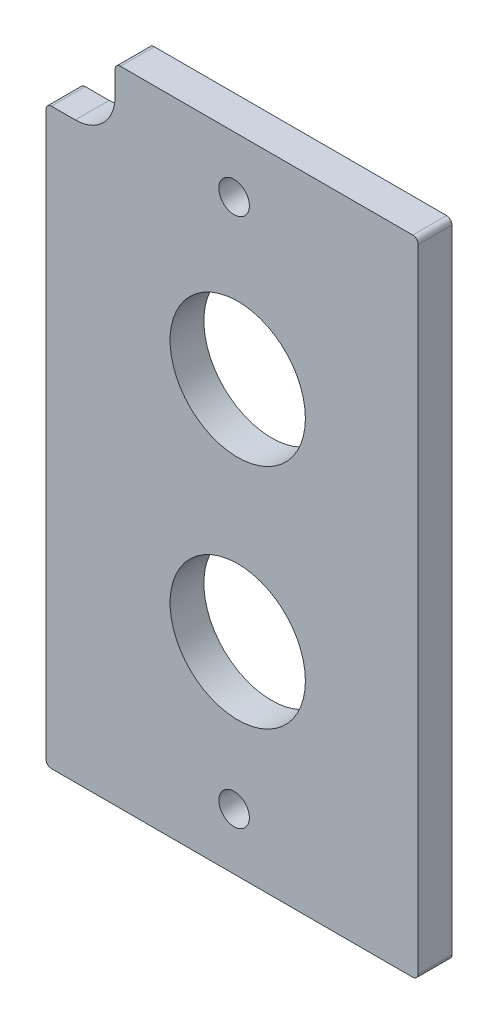
ISO-10303-21;
HEADER;
FILE_DESCRIPTION(('STEP AP214'),'2;1');
FILE_NAME('part.step','',(''),(''),'','','');
FILE_SCHEMA(('AUTOMOTIVE_DESIGN { 1 0 10303 214 1 1 1 1 }'));
ENDSEC;
DATA;
#1=APPLICATION_CONTEXT('core data for automotive mechanical design processes');
#2=APPLICATION_PROTOCOL_DEFINITION('international standard','automotive_design',2000,#1);
#3=PRODUCT_CONTEXT('',#1,'mechanical');
#4=PRODUCT('Part','Part','',(#3));
#5=PRODUCT_RELATED_PRODUCT_CATEGORY('part','',(#4));
#6=PRODUCT_DEFINITION_FORMATION('','',#4);
#7=PRODUCT_DEFINITION_CONTEXT('part definition',#1,'design');
#8=PRODUCT_DEFINITION('design','',#6,#7);
#9=PRODUCT_DEFINITION_SHAPE('','',#8);
#10=(LENGTH_UNIT() NAMED_UNIT(*) SI_UNIT(.MILLI.,.METRE.));
#11=(NAMED_UNIT(*) PLANE_ANGLE_UNIT() SI_UNIT($,.RADIAN.));
#12=(NAMED_UNIT(*) SI_UNIT($,.STERADIAN.) SOLID_ANGLE_UNIT());
#13=UNCERTAINTY_MEASURE_WITH_UNIT(LENGTH_MEASURE(1.E-05),#10,'distance_accuracy_value','');
#14=(GEOMETRIC_REPRESENTATION_CONTEXT(3) GLOBAL_UNCERTAINTY_ASSIGNED_CONTEXT((#13)) GLOBAL_UNIT_ASSIGNED_CONTEXT((#10,
#11,#12)) REPRESENTATION_CONTEXT('',''));
#15=CARTESIAN_POINT('',(0.,0.,0.));
#16=DIRECTION('',(0.,0.,1.));
#17=DIRECTION('',(1.,0.,0.));
#18=AXIS2_PLACEMENT_3D('',#15,#16,#17);
#19=CARTESIAN_POINT('',(-50.8,130.175,4.7625));
#20=DIRECTION('',(0.,0.,-1.));
#21=DIRECTION('',(-1.,0.,0.));
#22=AXIS2_PLACEMENT_3D('',#19,#20,#21);
#23=CYLINDRICAL_SURFACE('',#22,5.58799999999998);
#24=CARTESIAN_POINT('',(-50.8,130.175,0.));
#25=DIRECTION('',(0.,0.,-1.));
#26=DIRECTION('',(1.,0.,0.));
#27=AXIS2_PLACEMENT_3D('',#24,#25,#26);
#28=CIRCLE('',#27,5.58799999999998);
#29=CARTESIAN_POINT('',(-45.212,130.175,0.));
#30=VERTEX_POINT('',#29);
#31=CARTESIAN_POINT('',(-50.8,124.587,0.));
#32=VERTEX_POINT('',#31);
#33=EDGE_CURVE('E152',#30,#32,#28,.T.);
#34=ORIENTED_EDGE('',*,*,#33,.T.);
#35=DIRECTION('',(0.,0.,-1.));
#36=VECTOR('',#35,1.);
#37=CARTESIAN_POINT('',(-50.8,124.587,4.7625));
#38=LINE('',#37,#36);
#39=CARTESIAN_POINT('',(-50.8,124.587,4.7625));
#40=VERTEX_POINT('',#39);
#41=EDGE_CURVE('E11',#40,#32,#38,.T.);
#42=ORIENTED_EDGE('',*,*,#41,.F.);
#43=CARTESIAN_POINT('',(-50.8,130.175,4.7625));
#44=DIRECTION('',(0.,0.,-1.));
#45=DIRECTION('',(1.,0.,0.));
#46=AXIS2_PLACEMENT_3D('',#43,#44,#45);
#47=CIRCLE('',#46,5.58799999999998);
#48=CARTESIAN_POINT('',(-45.212,130.175,4.7625));
#49=VERTEX_POINT('',#48);
#50=EDGE_CURVE('E175',#49,#40,#47,.T.);
#51=ORIENTED_EDGE('',*,*,#50,.F.);
#52=DIRECTION('',(0.,0.,-1.));
#53=VECTOR('',#52,1.);
#54=CARTESIAN_POINT('',(-45.212,130.175,4.7625));
#55=LINE('',#54,#53);
#56=EDGE_CURVE('E148',#49,#30,#55,.T.);
#57=ORIENTED_EDGE('',*,*,#56,.T.);
#58=EDGE_LOOP('',(#34,#42,#51,#57));
#59=FACE_BOUND('',#58,.T.);
#60=ADVANCED_FACE('F32',(#59),#23,.F.);
#61=CARTESIAN_POINT('',(-50.8,124.587,4.7625));
#62=DIRECTION('',(0.,-1.,0.));
#63=DIRECTION('',(1.,0.,0.));
#64=AXIS2_PLACEMENT_3D('',#61,#62,#63);
#65=PLANE('',#64);
#66=DIRECTION('',(-1.,0.,0.));
#67=VECTOR('',#66,1.);
#68=CARTESIAN_POINT('',(-50.8,124.587,0.));
#69=LINE('',#68,#67);
#70=CARTESIAN_POINT('',(-54.1655,124.587,0.));
#71=VERTEX_POINT('',#70);
#72=EDGE_CURVE('E155',#32,#71,#69,.T.);
#73=ORIENTED_EDGE('',*,*,#72,.T.);
#74=DIRECTION('',(0.,0.,-1.));
#75=VECTOR('',#74,1.);
#76=CARTESIAN_POINT('',(-54.1655,124.587,4.7625));
#77=LINE('',#76,#75);
#78=CARTESIAN_POINT('',(-54.1655,124.587,4.7625));
#79=VERTEX_POINT('',#78);
#80=EDGE_CURVE('E40',#79,#71,#77,.T.);
#81=ORIENTED_EDGE('',*,*,#80,.F.);
#82=DIRECTION('',(-1.,0.,0.));
#83=VECTOR('',#82,1.);
#84=CARTESIAN_POINT('',(-50.8,124.587,4.7625));
#85=LINE('',#84,#83);
#86=EDGE_CURVE('E103',#40,#79,#85,.T.);
#87=ORIENTED_EDGE('',*,*,#86,.F.);
#88=ORIENTED_EDGE('',*,*,#41,.T.);
#89=EDGE_LOOP('',(#73,#81,#87,#88));
#90=FACE_BOUND('',#89,.T.);
#91=ADVANCED_FACE('F254',(#90),#65,.F.);
#92=CARTESIAN_POINT('',(-54.1655,123.825,4.7625));
#93=DIRECTION('',(0.,0.,-1.));
#94=DIRECTION('',(-1.,0.,0.));
#95=AXIS2_PLACEMENT_3D('',#92,#93,#94);
#96=CYLINDRICAL_SURFACE('',#95,0.762000000000002);
#97=CARTESIAN_POINT('',(-54.1655,123.825,0.));
#98=DIRECTION('',(0.,0.,1.));
#99=DIRECTION('',(1.,0.,0.));
#100=AXIS2_PLACEMENT_3D('',#97,#98,#99);
#101=CIRCLE('',#100,0.762000000000002);
#102=CARTESIAN_POINT('',(-54.9275,123.825,0.));
#103=VERTEX_POINT('',#102);
#104=EDGE_CURVE('E158',#71,#103,#101,.T.);
#105=ORIENTED_EDGE('',*,*,#104,.T.);
#106=DIRECTION('',(0.,0.,-1.));
#107=VECTOR('',#106,1.);
#108=CARTESIAN_POINT('',(-54.9275,123.825,4.7625));
#109=LINE('',#108,#107);
#110=CARTESIAN_POINT('',(-54.9275,123.825,4.7625));
#111=VERTEX_POINT('',#110);
#112=EDGE_CURVE('E194',#111,#103,#109,.T.);
#113=ORIENTED_EDGE('',*,*,#112,.F.);
#114=CARTESIAN_POINT('',(-54.1655,123.825,4.7625));
#115=DIRECTION('',(0.,0.,1.));
#116=DIRECTION('',(1.,0.,0.));
#117=AXIS2_PLACEMENT_3D('',#114,#115,#116);
#118=CIRCLE('',#117,0.762000000000002);
#119=EDGE_CURVE('E202',#79,#111,#118,.T.);
#120=ORIENTED_EDGE('',*,*,#119,.F.);
#121=ORIENTED_EDGE('',*,*,#80,.T.);
#122=EDGE_LOOP('',(#105,#113,#120,#121));
#123=FACE_BOUND('',#122,.T.);
#124=ADVANCED_FACE('F200',(#123),#96,.T.);
#125=CARTESIAN_POINT('',(-54.9275,123.825,4.7625));
#126=DIRECTION('',(1.,0.,0.));
#127=DIRECTION('',(0.,1.,0.));
#128=AXIS2_PLACEMENT_3D('',#125,#126,#127);
#129=PLANE('',#128);
#130=DIRECTION('',(0.,-1.,0.));
#131=VECTOR('',#130,1.);
#132=CARTESIAN_POINT('',(-54.9275,123.825,0.));
#133=LINE('',#132,#131);
#134=CARTESIAN_POINT('',(-54.9274999999998,44.577,0.));
#135=VERTEX_POINT('',#134);
#136=EDGE_CURVE('E160',#103,#135,#133,.T.);
#137=ORIENTED_EDGE('',*,*,#136,.T.);
#138=DIRECTION('',(0.,0.,-1.));
#139=VECTOR('',#138,1.);
#140=CARTESIAN_POINT('',(-54.9274999999998,44.577,4.7625));
#141=LINE('',#140,#139);
#142=CARTESIAN_POINT('',(-54.9274999999998,44.577,4.7625));
#143=VERTEX_POINT('',#142);
#144=EDGE_CURVE('E191',#143,#135,#141,.T.);
#145=ORIENTED_EDGE('',*,*,#144,.F.);
#146=DIRECTION('',(0.,-1.,0.));
#147=VECTOR('',#146,1.);
#148=CARTESIAN_POINT('',(-54.9275,123.825,4.7625));
#149=LINE('',#148,#147);
#150=EDGE_CURVE('E220',#111,#143,#149,.T.);
#151=ORIENTED_EDGE('',*,*,#150,.F.);
#152=ORIENTED_EDGE('',*,*,#112,.T.);
#153=EDGE_LOOP('',(#137,#145,#151,#152));
#154=FACE_BOUND('',#153,.T.);
#155=ADVANCED_FACE('F211',(#154),#129,.F.);
#156=CARTESIAN_POINT('',(-54.1654999999997,44.577,4.7625));
#157=DIRECTION('',(0.,0.,-1.));
#158=DIRECTION('',(-1.,0.,0.));
#159=AXIS2_PLACEMENT_3D('',#156,#157,#158);
#160=CYLINDRICAL_SURFACE('',#159,0.762000000000034);
#161=CARTESIAN_POINT('',(-54.1654999999997,44.577,0.));
#162=DIRECTION('',(0.,0.,1.));
#163=DIRECTION('',(1.,0.,0.));
#164=AXIS2_PLACEMENT_3D('',#161,#162,#163);
#165=CIRCLE('',#164,0.762000000000034);
#166=CARTESIAN_POINT('',(-54.1654999999997,43.815,0.));
#167=VERTEX_POINT('',#166);
#168=EDGE_CURVE('E162',#135,#167,#165,.T.);
#169=ORIENTED_EDGE('',*,*,#168,.T.);
#170=DIRECTION('',(0.,0.,-1.));
#171=VECTOR('',#170,1.);
#172=CARTESIAN_POINT('',(-54.1654999999997,43.815,4.7625));
#173=LINE('',#172,#171);
#174=CARTESIAN_POINT('',(-54.1654999999997,43.815,4.7625));
#175=VERTEX_POINT('',#174);
#176=EDGE_CURVE('E188',#175,#167,#173,.T.);
#177=ORIENTED_EDGE('',*,*,#176,.F.);
#178=CARTESIAN_POINT('',(-54.1654999999997,44.577,4.7625));
#179=DIRECTION('',(0.,0.,1.));
#180=DIRECTION('',(1.,0.,0.));
#181=AXIS2_PLACEMENT_3D('',#178,#179,#180);
#182=CIRCLE('',#181,0.762000000000034);
#183=EDGE_CURVE('E217',#143,#175,#182,.T.);
#184=ORIENTED_EDGE('',*,*,#183,.F.);
#185=ORIENTED_EDGE('',*,*,#144,.T.);
#186=EDGE_LOOP('',(#169,#177,#184,#185));
#187=FACE_BOUND('',#186,.T.);
#188=ADVANCED_FACE('F215',(#187),#160,.T.);
#189=CARTESIAN_POINT('',(-54.1654999999997,43.815,4.7625));
#190=DIRECTION('',(0.,1.,0.));
#191=DIRECTION('',(0.,0.,1.));
#192=AXIS2_PLACEMENT_3D('',#189,#190,#191);
#193=PLANE('',#192);
#194=DIRECTION('',(1.,0.,0.));
#195=VECTOR('',#194,1.);
#196=CARTESIAN_POINT('',(-54.1654999999997,43.815,0.));
#197=LINE('',#196,#195);
#198=CARTESIAN_POINT('',(-3.302,43.815,0.));
#199=VERTEX_POINT('',#198);
#200=EDGE_CURVE('E164',#167,#199,#197,.T.);
#201=ORIENTED_EDGE('',*,*,#200,.T.);
#202=DIRECTION('',(0.,0.,-1.));
#203=VECTOR('',#202,1.);
#204=CARTESIAN_POINT('',(-3.302,43.815,4.7625));
#205=LINE('',#204,#203);
#206=CARTESIAN_POINT('',(-3.302,43.815,4.7625));
#207=VERTEX_POINT('',#206);
#208=EDGE_CURVE('E185',#207,#199,#205,.T.);
#209=ORIENTED_EDGE('',*,*,#208,.F.);
#210=DIRECTION('',(1.,0.,0.));
#211=VECTOR('',#210,1.);
#212=CARTESIAN_POINT('',(-54.1654999999997,43.815,4.7625));
#213=LINE('',#212,#211);
#214=EDGE_CURVE('E219',#175,#207,#213,.T.);
#215=ORIENTED_EDGE('',*,*,#214,.F.);
#216=ORIENTED_EDGE('',*,*,#176,.T.);
#217=EDGE_LOOP('',(#201,#209,#215,#216));
#218=FACE_BOUND('',#217,.T.);
#219=ADVANCED_FACE('F267',(#218),#193,.F.);
#220=CARTESIAN_POINT('',(-3.302,44.577,4.7625));
#221=DIRECTION('',(0.,0.,-1.));
#222=DIRECTION('',(-1.,0.,0.));
#223=AXIS2_PLACEMENT_3D('',#220,#221,#222);
#224=CYLINDRICAL_SURFACE('',#223,0.761999999999999);
#225=CARTESIAN_POINT('',(-3.302,44.577,0.));
#226=DIRECTION('',(0.,0.,1.));
#227=DIRECTION('',(1.,0.,0.));
#228=AXIS2_PLACEMENT_3D('',#225,#226,#227);
#229=CIRCLE('',#228,0.761999999999999);
#230=CARTESIAN_POINT('',(-2.54,44.577,0.));
#231=VERTEX_POINT('',#230);
#232=EDGE_CURVE('E166',#199,#231,#229,.T.);
#233=ORIENTED_EDGE('',*,*,#232,.T.);
#234=DIRECTION('',(0.,0.,-1.));
#235=VECTOR('',#234,1.);
#236=CARTESIAN_POINT('',(-2.54,44.577,4.7625));
#237=LINE('',#236,#235);
#238=CARTESIAN_POINT('',(-2.54,44.577,4.7625));
#239=VERTEX_POINT('',#238);
#240=EDGE_CURVE('E182',#239,#231,#237,.T.);
#241=ORIENTED_EDGE('',*,*,#240,.F.);
#242=CARTESIAN_POINT('',(-3.302,44.577,4.7625));
#243=DIRECTION('',(0.,0.,1.));
#244=DIRECTION('',(1.,0.,0.));
#245=AXIS2_PLACEMENT_3D('',#242,#243,#244);
#246=CIRCLE('',#245,0.761999999999999);
#247=EDGE_CURVE('E222',#207,#239,#246,.T.);
#248=ORIENTED_EDGE('',*,*,#247,.F.);
#249=ORIENTED_EDGE('',*,*,#208,.T.);
#250=EDGE_LOOP('',(#233,#241,#248,#249));
#251=FACE_BOUND('',#250,.T.);
#252=ADVANCED_FACE('F270',(#251),#224,.T.);
#253=CARTESIAN_POINT('',(-2.54,44.577,4.7625));
#254=DIRECTION('',(-1.,0.,0.));
#255=DIRECTION('',(0.,-1.,0.));
#256=AXIS2_PLACEMENT_3D('',#253,#254,#255);
#257=PLANE('',#256);
#258=DIRECTION('',(0.,1.,0.));
#259=VECTOR('',#258,1.);
#260=CARTESIAN_POINT('',(-2.54,44.577,0.));
#261=LINE('',#260,#259);
#262=CARTESIAN_POINT('',(-2.54000000000001,133.5405,0.));
#263=VERTEX_POINT('',#262);
#264=EDGE_CURVE('E168',#231,#263,#261,.T.);
#265=ORIENTED_EDGE('',*,*,#264,.T.);
#266=DIRECTION('',(0.,0.,-1.));
#267=VECTOR('',#266,1.);
#268=CARTESIAN_POINT('',(-2.54000000000001,133.5405,4.7625));
#269=LINE('',#268,#267);
#270=CARTESIAN_POINT('',(-2.54000000000001,133.5405,4.7625));
#271=VERTEX_POINT('',#270);
#272=EDGE_CURVE('E179',#271,#263,#269,.T.);
#273=ORIENTED_EDGE('',*,*,#272,.F.);
#274=DIRECTION('',(0.,1.,0.));
#275=VECTOR('',#274,1.);
#276=CARTESIAN_POINT('',(-2.54,44.577,4.7625));
#277=LINE('',#276,#275);
#278=EDGE_CURVE('E228',#239,#271,#277,.T.);
#279=ORIENTED_EDGE('',*,*,#278,.F.);
#280=ORIENTED_EDGE('',*,*,#240,.T.);
#281=EDGE_LOOP('',(#265,#273,#279,#280));
#282=FACE_BOUND('',#281,.T.);
#283=ADVANCED_FACE('F234',(#282),#257,.F.);
#284=CARTESIAN_POINT('',(-3.302,133.5405,4.7625));
#285=DIRECTION('',(0.,0.,-1.));
#286=DIRECTION('',(-1.,0.,0.));
#287=AXIS2_PLACEMENT_3D('',#284,#285,#286);
#288=CYLINDRICAL_SURFACE('',#287,0.761999999999989);
#289=CARTESIAN_POINT('',(-3.302,133.5405,0.));
#290=DIRECTION('',(0.,0.,1.));
#291=DIRECTION('',(1.,0.,0.));
#292=AXIS2_PLACEMENT_3D('',#289,#290,#291);
#293=CIRCLE('',#292,0.761999999999989);
#294=CARTESIAN_POINT('',(-3.302,134.3025,0.));
#295=VERTEX_POINT('',#294);
#296=EDGE_CURVE('E170',#263,#295,#293,.T.);
#297=ORIENTED_EDGE('',*,*,#296,.T.);
#298=DIRECTION('',(0.,0.,-1.));
#299=VECTOR('',#298,1.);
#300=CARTESIAN_POINT('',(-3.302,134.3025,4.7625));
#301=LINE('',#300,#299);
#302=CARTESIAN_POINT('',(-3.302,134.3025,4.7625));
#303=VERTEX_POINT('',#302);
#304=EDGE_CURVE('E143',#303,#295,#301,.T.);
#305=ORIENTED_EDGE('',*,*,#304,.F.);
#306=CARTESIAN_POINT('',(-3.302,133.5405,4.7625));
#307=DIRECTION('',(0.,0.,1.));
#308=DIRECTION('',(1.,0.,0.));
#309=AXIS2_PLACEMENT_3D('',#306,#307,#308);
#310=CIRCLE('',#309,0.761999999999989);
#311=EDGE_CURVE('E134',#271,#303,#310,.T.);
#312=ORIENTED_EDGE('',*,*,#311,.F.);
#313=ORIENTED_EDGE('',*,*,#272,.T.);
#314=EDGE_LOOP('',(#297,#305,#312,#313));
#315=FACE_BOUND('',#314,.T.);
#316=ADVANCED_FACE('F238',(#315),#288,.T.);
#317=CARTESIAN_POINT('',(-3.302,134.3025,4.7625));
#318=DIRECTION('',(0.,-1.,0.));
#319=DIRECTION('',(0.,0.,-1.));
#320=AXIS2_PLACEMENT_3D('',#317,#318,#319);
#321=PLANE('',#320);
#322=DIRECTION('',(-1.,0.,0.));
#323=VECTOR('',#322,1.);
#324=CARTESIAN_POINT('',(-3.302,134.3025,0.));
#325=LINE('',#324,#323);
#326=CARTESIAN_POINT('',(-44.45,134.3025,0.));
#327=VERTEX_POINT('',#326);
#328=EDGE_CURVE('E142',#295,#327,#325,.T.);
#329=ORIENTED_EDGE('',*,*,#328,.T.);
#330=DIRECTION('',(0.,0.,-1.));
#331=VECTOR('',#330,1.);
#332=CARTESIAN_POINT('',(-44.45,134.3025,4.7625));
#333=LINE('',#332,#331);
#334=CARTESIAN_POINT('',(-44.45,134.3025,4.7625));
#335=VERTEX_POINT('',#334);
#336=EDGE_CURVE('E139',#335,#327,#333,.T.);
#337=ORIENTED_EDGE('',*,*,#336,.F.);
#338=DIRECTION('',(-1.,0.,0.));
#339=VECTOR('',#338,1.);
#340=CARTESIAN_POINT('',(-3.302,134.3025,4.7625));
#341=LINE('',#340,#339);
#342=EDGE_CURVE('E128',#303,#335,#341,.T.);
#343=ORIENTED_EDGE('',*,*,#342,.F.);
#344=ORIENTED_EDGE('',*,*,#304,.T.);
#345=EDGE_LOOP('',(#329,#337,#343,#344));
#346=FACE_BOUND('',#345,.T.);
#347=ADVANCED_FACE('F140',(#346),#321,.F.);
#348=CARTESIAN_POINT('',(-44.45,133.5405,4.7625));
#349=DIRECTION('',(0.,0.,-1.));
#350=DIRECTION('',(-1.,0.,0.));
#351=AXIS2_PLACEMENT_3D('',#348,#349,#350);
#352=CYLINDRICAL_SURFACE('',#351,0.761999999999992);
#353=CARTESIAN_POINT('',(-44.45,133.5405,0.));
#354=DIRECTION('',(0.,0.,1.));
#355=DIRECTION('',(1.,0.,0.));
#356=AXIS2_PLACEMENT_3D('',#353,#354,#355);
#357=CIRCLE('',#356,0.761999999999992);
#358=CARTESIAN_POINT('',(-45.212,133.5405,0.));
#359=VERTEX_POINT('',#358);
#360=EDGE_CURVE('E89',#327,#359,#357,.T.);
#361=ORIENTED_EDGE('',*,*,#360,.T.);
#362=DIRECTION('',(0.,0.,-1.));
#363=VECTOR('',#362,1.);
#364=CARTESIAN_POINT('',(-45.212,133.5405,4.7625));
#365=LINE('',#364,#363);
#366=CARTESIAN_POINT('',(-45.212,133.5405,4.7625));
#367=VERTEX_POINT('',#366);
#368=EDGE_CURVE('E144',#367,#359,#365,.T.);
#369=ORIENTED_EDGE('',*,*,#368,.F.);
#370=CARTESIAN_POINT('',(-44.45,133.5405,4.7625));
#371=DIRECTION('',(0.,0.,1.));
#372=DIRECTION('',(1.,0.,0.));
#373=AXIS2_PLACEMENT_3D('',#370,#371,#372);
#374=CIRCLE('',#373,0.761999999999992);
#375=EDGE_CURVE('E132',#335,#367,#374,.T.);
#376=ORIENTED_EDGE('',*,*,#375,.F.);
#377=ORIENTED_EDGE('',*,*,#336,.T.);
#378=EDGE_LOOP('',(#361,#369,#376,#377));
#379=FACE_BOUND('',#378,.T.);
#380=ADVANCED_FACE('F146',(#379),#352,.T.);
#381=CARTESIAN_POINT('',(-45.212,133.5405,4.7625));
#382=DIRECTION('',(1.,0.,0.));
#383=DIRECTION('',(0.,1.,0.));
#384=AXIS2_PLACEMENT_3D('',#381,#382,#383);
#385=PLANE('',#384);
#386=DIRECTION('',(0.,-1.,0.));
#387=VECTOR('',#386,1.);
#388=CARTESIAN_POINT('',(-45.212,133.5405,0.));
#389=LINE('',#388,#387);
#390=EDGE_CURVE('E95',#359,#30,#389,.T.);
#391=ORIENTED_EDGE('',*,*,#390,.T.);
#392=ORIENTED_EDGE('',*,*,#56,.F.);
#393=DIRECTION('',(0.,-1.,0.));
#394=VECTOR('',#393,1.);
#395=CARTESIAN_POINT('',(-45.212,133.5405,4.7625));
#396=LINE('',#395,#394);
#397=EDGE_CURVE('E48',#367,#49,#396,.T.);
#398=ORIENTED_EDGE('',*,*,#397,.F.);
#399=ORIENTED_EDGE('',*,*,#368,.T.);
#400=EDGE_LOOP('',(#391,#392,#398,#399));
#401=FACE_BOUND('',#400,.T.);
#402=ADVANCED_FACE('F242',(#401),#385,.F.);
#403=CARTESIAN_POINT('',(-50.8,130.175,4.7625));
#404=DIRECTION('',(0.,0.,1.));
#405=DIRECTION('',(1.,0.,0.));
#406=AXIS2_PLACEMENT_3D('',#403,#404,#405);
#407=PLANE('',#406);
#408=CARTESIAN_POINT('',(-27.94,72.39,4.7625));
#409=DIRECTION('',(0.,0.,1.));
#410=DIRECTION('',(1.,0.,0.));
#411=AXIS2_PLACEMENT_3D('',#408,#409,#410);
#412=CIRCLE('',#411,9.525);
#413=CARTESIAN_POINT('',(-18.415,72.39,4.7625));
#414=VERTEX_POINT('',#413);
#415=EDGE_CURVE('E356',#414,#414,#412,.T.);
#416=ORIENTED_EDGE('',*,*,#415,.F.);
#417=EDGE_LOOP('',(#416));
#418=FACE_BOUND('',#417,.T.);
#419=CARTESIAN_POINT('',(-27.94,104.394,4.7625));
#420=DIRECTION('',(0.,0.,1.));
#421=DIRECTION('',(1.,0.,0.));
#422=AXIS2_PLACEMENT_3D('',#419,#420,#421);
#423=CIRCLE('',#422,9.525);
#424=CARTESIAN_POINT('',(-18.415,104.394,4.7625));
#425=VERTEX_POINT('',#424);
#426=EDGE_CURVE('E358',#425,#425,#423,.T.);
#427=ORIENTED_EDGE('',*,*,#426,.F.);
#428=EDGE_LOOP('',(#427));
#429=FACE_BOUND('',#428,.T.);
#430=CARTESIAN_POINT('',(-28.448,126.365,4.7625));
#431=DIRECTION('',(0.,0.,1.));
#432=DIRECTION('',(1.,0.,0.));
#433=AXIS2_PLACEMENT_3D('',#430,#431,#432);
#434=CIRCLE('',#433,2.15264999999999);
#435=CARTESIAN_POINT('',(-26.29535,126.365,4.7625));
#436=VERTEX_POINT('',#435);
#437=EDGE_CURVE('E366',#436,#436,#434,.T.);
#438=ORIENTED_EDGE('',*,*,#437,.F.);
#439=EDGE_LOOP('',(#438));
#440=FACE_BOUND('',#439,.T.);
#441=CARTESIAN_POINT('',(-28.448,51.7525,4.7625));
#442=DIRECTION('',(0.,0.,1.));
#443=DIRECTION('',(1.,0.,0.));
#444=AXIS2_PLACEMENT_3D('',#441,#442,#443);
#445=CIRCLE('',#444,2.15264999999999);
#446=CARTESIAN_POINT('',(-26.29535,51.7525,4.7625));
#447=VERTEX_POINT('',#446);
#448=EDGE_CURVE('E372',#447,#447,#445,.T.);
#449=ORIENTED_EDGE('',*,*,#448,.F.);
#450=EDGE_LOOP('',(#449));
#451=FACE_BOUND('',#450,.T.);
#452=ORIENTED_EDGE('',*,*,#50,.T.);
#453=ORIENTED_EDGE('',*,*,#86,.T.);
#454=ORIENTED_EDGE('',*,*,#119,.T.);
#455=ORIENTED_EDGE('',*,*,#150,.T.);
#456=ORIENTED_EDGE('',*,*,#183,.T.);
#457=ORIENTED_EDGE('',*,*,#214,.T.);
#458=ORIENTED_EDGE('',*,*,#247,.T.);
#459=ORIENTED_EDGE('',*,*,#278,.T.);
#460=ORIENTED_EDGE('',*,*,#311,.T.);
#461=ORIENTED_EDGE('',*,*,#342,.T.);
#462=ORIENTED_EDGE('',*,*,#375,.T.);
#463=ORIENTED_EDGE('',*,*,#397,.T.);
#464=EDGE_LOOP('',(#452,#453,#454,#455,#456,#457,#458,#459,#460,#461,#462,#463));
#465=FACE_BOUND('',#464,.T.);
#466=ADVANCED_FACE('F130',(#418,#429,#440,#451,#465),#407,.T.);
#467=CARTESIAN_POINT('',(-50.8,130.175,0.));
#468=DIRECTION('',(0.,0.,1.));
#469=DIRECTION('',(1.,0.,0.));
#470=AXIS2_PLACEMENT_3D('',#467,#468,#469);
#471=PLANE('',#470);
#472=CARTESIAN_POINT('',(-27.94,72.39,0.));
#473=DIRECTION('',(0.,0.,1.));
#474=DIRECTION('',(1.,0.,0.));
#475=AXIS2_PLACEMENT_3D('',#472,#473,#474);
#476=CIRCLE('',#475,9.525);
#477=CARTESIAN_POINT('',(-18.415,72.39,0.));
#478=VERTEX_POINT('',#477);
#479=EDGE_CURVE('E353',#478,#478,#476,.T.);
#480=ORIENTED_EDGE('',*,*,#479,.T.);
#481=EDGE_LOOP('',(#480));
#482=FACE_BOUND('',#481,.T.);
#483=CARTESIAN_POINT('',(-27.94,104.394,0.));
#484=DIRECTION('',(0.,0.,1.));
#485=DIRECTION('',(1.,0.,0.));
#486=AXIS2_PLACEMENT_3D('',#483,#484,#485);
#487=CIRCLE('',#486,9.525);
#488=CARTESIAN_POINT('',(-18.415,104.394,0.));
#489=VERTEX_POINT('',#488);
#490=EDGE_CURVE('E363',#489,#489,#487,.T.);
#491=ORIENTED_EDGE('',*,*,#490,.T.);
#492=EDGE_LOOP('',(#491));
#493=FACE_BOUND('',#492,.T.);
#494=CARTESIAN_POINT('',(-28.448,126.365,0.));
#495=DIRECTION('',(0.,0.,1.));
#496=DIRECTION('',(1.,0.,0.));
#497=AXIS2_PLACEMENT_3D('',#494,#495,#496);
#498=CIRCLE('',#497,2.15265);
#499=CARTESIAN_POINT('',(-26.29535,126.365,0.));
#500=VERTEX_POINT('',#499);
#501=EDGE_CURVE('E369',#500,#500,#498,.T.);
#502=ORIENTED_EDGE('',*,*,#501,.T.);
#503=EDGE_LOOP('',(#502));
#504=FACE_BOUND('',#503,.T.);
#505=CARTESIAN_POINT('',(-28.448,51.7525,0.));
#506=DIRECTION('',(0.,0.,1.));
#507=DIRECTION('',(1.,0.,0.));
#508=AXIS2_PLACEMENT_3D('',#505,#506,#507);
#509=CIRCLE('',#508,2.15265);
#510=CARTESIAN_POINT('',(-26.29535,51.7525,0.));
#511=VERTEX_POINT('',#510);
#512=EDGE_CURVE('E156',#511,#511,#509,.T.);
#513=ORIENTED_EDGE('',*,*,#512,.T.);
#514=EDGE_LOOP('',(#513));
#515=FACE_BOUND('',#514,.T.);
#516=ORIENTED_EDGE('',*,*,#33,.F.);
#517=ORIENTED_EDGE('',*,*,#390,.F.);
#518=ORIENTED_EDGE('',*,*,#360,.F.);
#519=ORIENTED_EDGE('',*,*,#328,.F.);
#520=ORIENTED_EDGE('',*,*,#296,.F.);
#521=ORIENTED_EDGE('',*,*,#264,.F.);
#522=ORIENTED_EDGE('',*,*,#232,.F.);
#523=ORIENTED_EDGE('',*,*,#200,.F.);
#524=ORIENTED_EDGE('',*,*,#168,.F.);
#525=ORIENTED_EDGE('',*,*,#136,.F.);
#526=ORIENTED_EDGE('',*,*,#104,.F.);
#527=ORIENTED_EDGE('',*,*,#72,.F.);
#528=EDGE_LOOP('',(#516,#517,#518,#519,#520,#521,#522,#523,#524,#525,#526,#527));
#529=FACE_BOUND('',#528,.T.);
#530=ADVANCED_FACE('F206',(#482,#493,#504,#515,#529),#471,.F.);
#531=CARTESIAN_POINT('',(-28.448,51.7525,4.7625));
#532=DIRECTION('',(0.,0.,1.));
#533=DIRECTION('',(1.,0.,0.));
#534=AXIS2_PLACEMENT_3D('',#531,#532,#533);
#535=CYLINDRICAL_SURFACE('',#534,2.15264999999999);
#536=ORIENTED_EDGE('',*,*,#512,.F.);
#537=EDGE_LOOP('',(#536));
#538=FACE_BOUND('',#537,.T.);
#539=ORIENTED_EDGE('',*,*,#448,.T.);
#540=EDGE_LOOP('',(#539));
#541=FACE_BOUND('',#540,.T.);
#542=ADVANCED_FACE('F298',(#538,#541),#535,.F.);
#543=CARTESIAN_POINT('',(-28.448,126.365,4.7625));
#544=DIRECTION('',(0.,0.,1.));
#545=DIRECTION('',(1.,0.,0.));
#546=AXIS2_PLACEMENT_3D('',#543,#544,#545);
#547=CYLINDRICAL_SURFACE('',#546,2.15264999999999);
#548=ORIENTED_EDGE('',*,*,#501,.F.);
#549=EDGE_LOOP('',(#548));
#550=FACE_BOUND('',#549,.T.);
#551=ORIENTED_EDGE('',*,*,#437,.T.);
#552=EDGE_LOOP('',(#551));
#553=FACE_BOUND('',#552,.T.);
#554=ADVANCED_FACE('F303',(#550,#553),#547,.F.);
#555=CARTESIAN_POINT('',(-27.94,104.394,4.7625));
#556=DIRECTION('',(0.,0.,1.));
#557=DIRECTION('',(1.,0.,0.));
#558=AXIS2_PLACEMENT_3D('',#555,#556,#557);
#559=CYLINDRICAL_SURFACE('',#558,9.525);
#560=ORIENTED_EDGE('',*,*,#490,.F.);
#561=EDGE_LOOP('',(#560));
#562=FACE_BOUND('',#561,.T.);
#563=ORIENTED_EDGE('',*,*,#426,.T.);
#564=EDGE_LOOP('',(#563));
#565=FACE_BOUND('',#564,.T.);
#566=ADVANCED_FACE('F315',(#562,#565),#559,.F.);
#567=CARTESIAN_POINT('',(-27.94,72.39,4.7625));
#568=DIRECTION('',(0.,0.,1.));
#569=DIRECTION('',(1.,0.,0.));
#570=AXIS2_PLACEMENT_3D('',#567,#568,#569);
#571=CYLINDRICAL_SURFACE('',#570,9.525);
#572=ORIENTED_EDGE('',*,*,#479,.F.);
#573=EDGE_LOOP('',(#572));
#574=FACE_BOUND('',#573,.T.);
#575=ORIENTED_EDGE('',*,*,#415,.T.);
#576=EDGE_LOOP('',(#575));
#577=FACE_BOUND('',#576,.T.);
#578=ADVANCED_FACE('F336',(#574,#577),#571,.F.);
#579=CLOSED_SHELL('',(#60,#91,#124,#155,#188,#219,#252,#283,#316,#347,#380,#402,#466,#530,#542,
#554,#566,#578));
#580=MANIFOLD_SOLID_BREP('B2',#579);
#581=ADVANCED_BREP_SHAPE_REPRESENTATION('',(#18,#580),#14);
#582=SHAPE_DEFINITION_REPRESENTATION(#9,#581);
ENDSEC;
END-ISO-10303-21;
